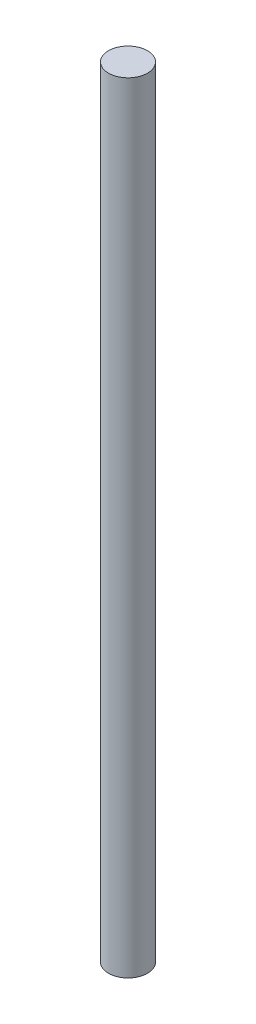
ISO-10303-21;
HEADER;
FILE_DESCRIPTION(('STEP AP214'),'2;1');
FILE_NAME('part.step','',(''),(''),'','','');
FILE_SCHEMA(('AUTOMOTIVE_DESIGN { 1 0 10303 214 1 1 1 1 }'));
ENDSEC;
DATA;
#1=APPLICATION_CONTEXT('core data for automotive mechanical design processes');
#2=APPLICATION_PROTOCOL_DEFINITION('international standard','automotive_design',2000,#1);
#3=PRODUCT_CONTEXT('',#1,'mechanical');
#4=PRODUCT('Part','Part','',(#3));
#5=PRODUCT_RELATED_PRODUCT_CATEGORY('part','',(#4));
#6=PRODUCT_DEFINITION_FORMATION('','',#4);
#7=PRODUCT_DEFINITION_CONTEXT('part definition',#1,'design');
#8=PRODUCT_DEFINITION('design','',#6,#7);
#9=PRODUCT_DEFINITION_SHAPE('','',#8);
#10=(LENGTH_UNIT() NAMED_UNIT(*) SI_UNIT(.MILLI.,.METRE.));
#11=(NAMED_UNIT(*) PLANE_ANGLE_UNIT() SI_UNIT($,.RADIAN.));
#12=(NAMED_UNIT(*) SI_UNIT($,.STERADIAN.) SOLID_ANGLE_UNIT());
#13=UNCERTAINTY_MEASURE_WITH_UNIT(LENGTH_MEASURE(1.E-05),#10,'distance_accuracy_value','');
#14=(GEOMETRIC_REPRESENTATION_CONTEXT(3) GLOBAL_UNCERTAINTY_ASSIGNED_CONTEXT((#13)) GLOBAL_UNIT_ASSIGNED_CONTEXT((#10,
#11,#12)) REPRESENTATION_CONTEXT('',''));
#15=CARTESIAN_POINT('',(0.,0.,0.));
#16=DIRECTION('',(0.,0.,1.));
#17=DIRECTION('',(1.,0.,0.));
#18=AXIS2_PLACEMENT_3D('',#15,#16,#17);
#19=CARTESIAN_POINT('',(0.,40.,0.));
#20=DIRECTION('',(0.,-1.,0.));
#21=DIRECTION('',(0.,0.,-1.));
#22=AXIS2_PLACEMENT_3D('',#19,#20,#21);
#23=CYLINDRICAL_SURFACE('',#22,1.);
#24=CARTESIAN_POINT('',(0.,40.,0.));
#25=DIRECTION('',(0.,1.,0.));
#26=DIRECTION('',(0.,0.,1.));
#27=AXIS2_PLACEMENT_3D('',#24,#25,#26);
#28=CIRCLE('',#27,1.);
#29=CARTESIAN_POINT('',(0.,40.,1.));
#30=VERTEX_POINT('',#29);
#31=EDGE_CURVE('E10',#30,#30,#28,.T.);
#32=ORIENTED_EDGE('',*,*,#31,.F.);
#33=EDGE_LOOP('',(#32));
#34=FACE_BOUND('',#33,.T.);
#35=CARTESIAN_POINT('',(0.,0.,0.));
#36=DIRECTION('',(0.,1.,0.));
#37=DIRECTION('',(0.,0.,1.));
#38=AXIS2_PLACEMENT_3D('',#35,#36,#37);
#39=CIRCLE('',#38,1.);
#40=CARTESIAN_POINT('',(0.,0.,1.));
#41=VERTEX_POINT('',#40);
#42=EDGE_CURVE('E37',#41,#41,#39,.T.);
#43=ORIENTED_EDGE('',*,*,#42,.T.);
#44=EDGE_LOOP('',(#43));
#45=FACE_BOUND('',#44,.T.);
#46=ADVANCED_FACE('F34',(#34,#45),#23,.T.);
#47=CARTESIAN_POINT('',(0.,40.,0.));
#48=DIRECTION('',(0.,1.,0.));
#49=DIRECTION('',(0.,0.,1.));
#50=AXIS2_PLACEMENT_3D('',#47,#48,#49);
#51=PLANE('',#50);
#52=ORIENTED_EDGE('',*,*,#31,.T.);
#53=EDGE_LOOP('',(#52));
#54=FACE_BOUND('',#53,.T.);
#55=ADVANCED_FACE('F49',(#54),#51,.T.);
#56=CARTESIAN_POINT('',(0.,0.,0.));
#57=DIRECTION('',(0.,1.,0.));
#58=DIRECTION('',(0.,0.,1.));
#59=AXIS2_PLACEMENT_3D('',#56,#57,#58);
#60=PLANE('',#59);
#61=ORIENTED_EDGE('',*,*,#42,.F.);
#62=EDGE_LOOP('',(#61));
#63=FACE_BOUND('',#62,.T.);
#64=ADVANCED_FACE('F47',(#63),#60,.F.);
#65=CLOSED_SHELL('',(#46,#55,#64));
#66=MANIFOLD_SOLID_BREP('B2',#65);
#67=ADVANCED_BREP_SHAPE_REPRESENTATION('',(#18,#66),#14);
#68=SHAPE_DEFINITION_REPRESENTATION(#9,#67);
ENDSEC;
END-ISO-10303-21;
